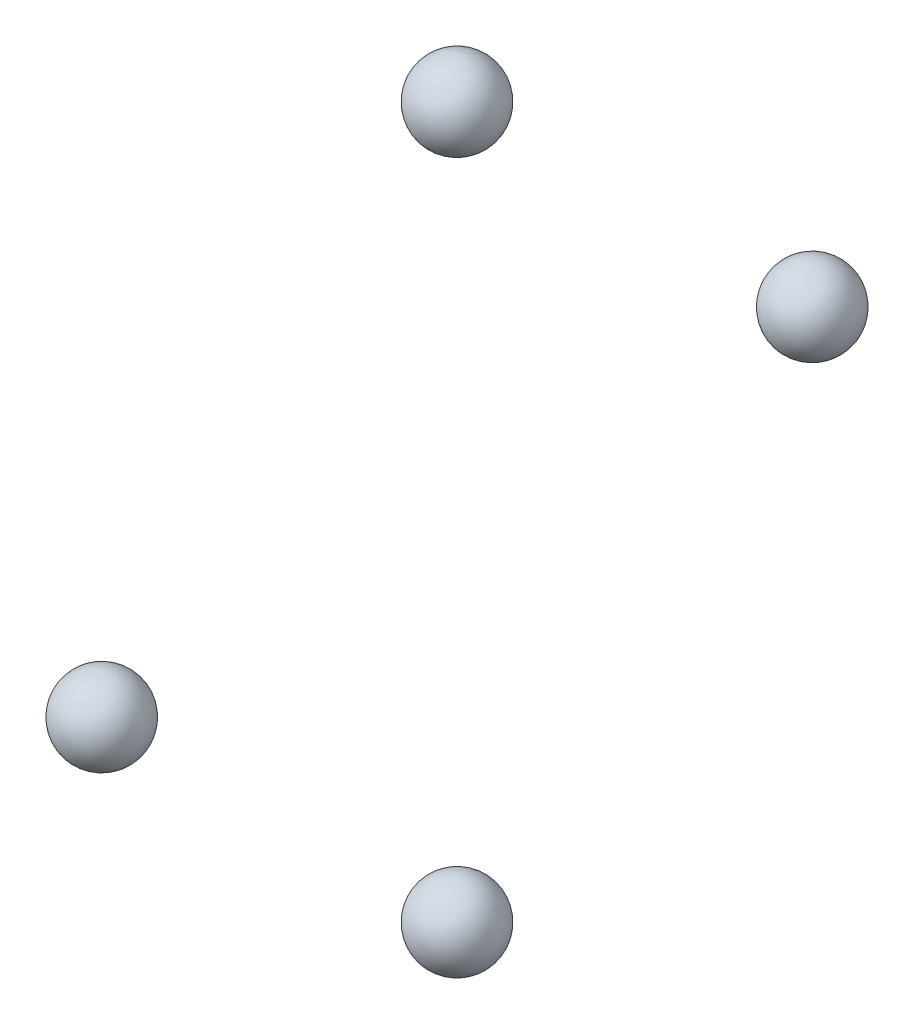
ISO-10303-21;
HEADER;
FILE_DESCRIPTION(('STEP AP214'),'2;1');
FILE_NAME('part.step','',(''),(''),'','','');
FILE_SCHEMA(('AUTOMOTIVE_DESIGN { 1 0 10303 214 1 1 1 1 }'));
ENDSEC;
DATA;
#1=APPLICATION_CONTEXT('core data for automotive mechanical design processes');
#2=APPLICATION_PROTOCOL_DEFINITION('international standard','automotive_design',2000,#1);
#3=PRODUCT_CONTEXT('',#1,'mechanical');
#4=PRODUCT('Part','Part','',(#3));
#5=PRODUCT_RELATED_PRODUCT_CATEGORY('part','',(#4));
#6=PRODUCT_DEFINITION_FORMATION('','',#4);
#7=PRODUCT_DEFINITION_CONTEXT('part definition',#1,'design');
#8=PRODUCT_DEFINITION('design','',#6,#7);
#9=PRODUCT_DEFINITION_SHAPE('','',#8);
#10=(LENGTH_UNIT() NAMED_UNIT(*) SI_UNIT(.MILLI.,.METRE.));
#11=(NAMED_UNIT(*) PLANE_ANGLE_UNIT() SI_UNIT($,.RADIAN.));
#12=(NAMED_UNIT(*) SI_UNIT($,.STERADIAN.) SOLID_ANGLE_UNIT());
#13=UNCERTAINTY_MEASURE_WITH_UNIT(LENGTH_MEASURE(1.E-05),#10,'distance_accuracy_value','');
#14=(GEOMETRIC_REPRESENTATION_CONTEXT(3) GLOBAL_UNCERTAINTY_ASSIGNED_CONTEXT((#13)) GLOBAL_UNIT_ASSIGNED_CONTEXT((#10,
#11,#12)) REPRESENTATION_CONTEXT('',''));
#15=CARTESIAN_POINT('',(0.,0.,0.));
#16=DIRECTION('',(0.,0.,1.));
#17=DIRECTION('',(1.,0.,0.));
#18=AXIS2_PLACEMENT_3D('',#15,#16,#17);
#19=CARTESIAN_POINT('',(5.5,0.,19.75));
#20=DIRECTION('',(0.493031442589746,0.629983259520278,0.600034240141411));
#21=DIRECTION('',(-0.108835700607648,-0.639606969986032,0.760958418192827));
#22=AXIS2_PLACEMENT_3D('',#19,#20,#21);
#23=SPHERICAL_SURFACE('',#22,2.2);
#24=CARTESIAN_POINT('',(6.58466917369744,1.38596317094461,21.0700753283111));
#25=VERTEX_POINT('',#24);
#26=VERTEX_LOOP('',#25);
#27=FACE_BOUND('',#26,.T.);
#28=CARTESIAN_POINT('',(4.41533082630256,-1.38596317094461,18.4299246716889));
#29=VERTEX_POINT('',#28);
#30=VERTEX_LOOP('',#29);
#31=FACE_BOUND('',#30,.T.);
#32=ADVANCED_FACE('P0_F15',(#27,#31),#23,.T.);
#33=CLOSED_SHELL('',(#32));
#34=MANIFOLD_SOLID_BREP('P0_B1',#33);
#35=CARTESIAN_POINT('',(5.5,-19.75,0.));
#36=DIRECTION('',(0.493031442589746,0.629983259520278,0.600034240141411));
#37=DIRECTION('',(-0.108835700607648,-0.639606969986032,0.760958418192827));
#38=AXIS2_PLACEMENT_3D('',#35,#36,#37);
#39=SPHERICAL_SURFACE('',#38,2.2);
#40=CARTESIAN_POINT('',(4.41533082630256,-21.1359631709446,-1.3200753283111));
#41=VERTEX_POINT('',#40);
#42=VERTEX_LOOP('',#41);
#43=FACE_BOUND('',#42,.T.);
#44=CARTESIAN_POINT('',(6.58466917369744,-18.3640368290554,1.3200753283111));
#45=VERTEX_POINT('',#44);
#46=VERTEX_LOOP('',#45);
#47=FACE_BOUND('',#46,.T.);
#48=ADVANCED_FACE('P1_F15',(#43,#47),#39,.T.);
#49=CLOSED_SHELL('',(#48));
#50=MANIFOLD_SOLID_BREP('P1_B1',#49);
#51=CARTESIAN_POINT('',(5.5,0.,-19.75));
#52=DIRECTION('',(0.493031442589746,0.629983259520278,0.600034240141411));
#53=DIRECTION('',(-0.108835700607648,-0.639606969986032,0.760958418192828));
#54=AXIS2_PLACEMENT_3D('',#51,#52,#53);
#55=SPHERICAL_SURFACE('',#54,2.2);
#56=CARTESIAN_POINT('',(4.41533082630256,-1.38596317094461,-21.0700753283111));
#57=VERTEX_POINT('',#56);
#58=VERTEX_LOOP('',#57);
#59=FACE_BOUND('',#58,.T.);
#60=CARTESIAN_POINT('',(6.58466917369744,1.38596317094461,-18.4299246716889));
#61=VERTEX_POINT('',#60);
#62=VERTEX_LOOP('',#61);
#63=FACE_BOUND('',#62,.T.);
#64=ADVANCED_FACE('P2_F15',(#59,#63),#55,.T.);
#65=CLOSED_SHELL('',(#64));
#66=MANIFOLD_SOLID_BREP('P2_B1',#65);
#67=CARTESIAN_POINT('',(5.5,19.75,0.));
#68=DIRECTION('',(0.493031442589746,0.629983259520278,0.600034240141411));
#69=DIRECTION('',(-0.108835700607648,-0.639606969986032,0.760958418192827));
#70=AXIS2_PLACEMENT_3D('',#67,#68,#69);
#71=SPHERICAL_SURFACE('',#70,2.2);
#72=CARTESIAN_POINT('',(6.58466917369744,21.1359631709446,1.3200753283111));
#73=VERTEX_POINT('',#72);
#74=VERTEX_LOOP('',#73);
#75=FACE_BOUND('',#74,.T.);
#76=CARTESIAN_POINT('',(4.41533082630256,18.3640368290554,-1.3200753283111));
#77=VERTEX_POINT('',#76);
#78=VERTEX_LOOP('',#77);
#79=FACE_BOUND('',#78,.T.);
#80=ADVANCED_FACE('P3_F15',(#75,#79),#71,.T.);
#81=CLOSED_SHELL('',(#80));
#82=MANIFOLD_SOLID_BREP('P3_B1',#81);
#83=ADVANCED_BREP_SHAPE_REPRESENTATION('',(#18,#34,#50,#66,#82),#14);
#84=SHAPE_DEFINITION_REPRESENTATION(#9,#83);
ENDSEC;
END-ISO-10303-21;
